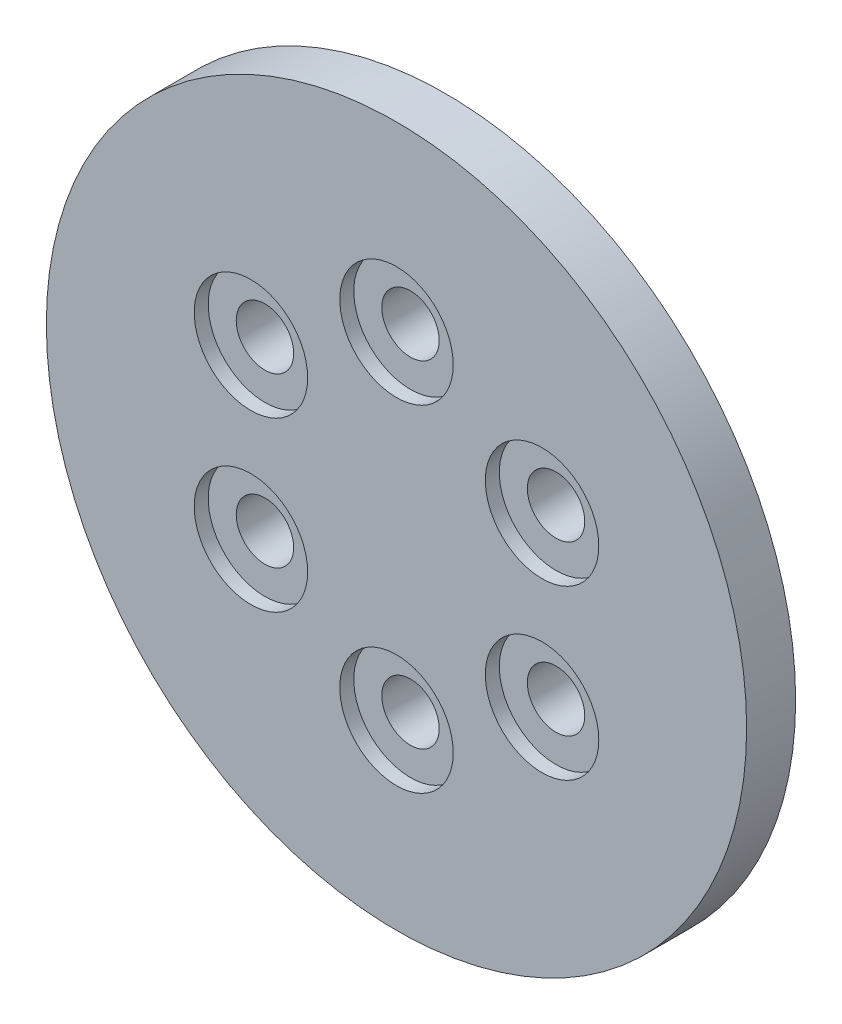
ISO-10303-21;
HEADER;
FILE_DESCRIPTION(('STEP AP214'),'2;1');
FILE_NAME('part.step','',(''),(''),'','','');
FILE_SCHEMA(('AUTOMOTIVE_DESIGN { 1 0 10303 214 1 1 1 1 }'));
ENDSEC;
DATA;
#1=APPLICATION_CONTEXT('core data for automotive mechanical design processes');
#2=APPLICATION_PROTOCOL_DEFINITION('international standard','automotive_design',2000,#1);
#3=PRODUCT_CONTEXT('',#1,'mechanical');
#4=PRODUCT('Part','Part','',(#3));
#5=PRODUCT_RELATED_PRODUCT_CATEGORY('part','',(#4));
#6=PRODUCT_DEFINITION_FORMATION('','',#4);
#7=PRODUCT_DEFINITION_CONTEXT('part definition',#1,'design');
#8=PRODUCT_DEFINITION('design','',#6,#7);
#9=PRODUCT_DEFINITION_SHAPE('','',#8);
#10=(LENGTH_UNIT() NAMED_UNIT(*) SI_UNIT(.MILLI.,.METRE.));
#11=(NAMED_UNIT(*) PLANE_ANGLE_UNIT() SI_UNIT($,.RADIAN.));
#12=(NAMED_UNIT(*) SI_UNIT($,.STERADIAN.) SOLID_ANGLE_UNIT());
#13=UNCERTAINTY_MEASURE_WITH_UNIT(LENGTH_MEASURE(1.E-05),#10,'distance_accuracy_value','');
#14=(GEOMETRIC_REPRESENTATION_CONTEXT(3) GLOBAL_UNCERTAINTY_ASSIGNED_CONTEXT((#13)) GLOBAL_UNIT_ASSIGNED_CONTEXT((#10,
#11,#12)) REPRESENTATION_CONTEXT('',''));
#15=CARTESIAN_POINT('',(0.,0.,0.));
#16=DIRECTION('',(0.,0.,1.));
#17=DIRECTION('',(1.,0.,0.));
#18=AXIS2_PLACEMENT_3D('',#15,#16,#17);
#19=CARTESIAN_POINT('',(0.,0.,4.));
#20=DIRECTION('',(0.,0.,-1.));
#21=DIRECTION('',(-1.,0.,0.));
#22=AXIS2_PLACEMENT_3D('',#19,#20,#21);
#23=CYLINDRICAL_SURFACE('',#22,25.);
#24=CARTESIAN_POINT('',(0.,0.,4.));
#25=DIRECTION('',(0.,0.,1.));
#26=DIRECTION('',(1.,0.,0.));
#27=AXIS2_PLACEMENT_3D('',#24,#25,#26);
#28=CIRCLE('',#27,25.);
#29=CARTESIAN_POINT('',(25.,0.,4.));
#30=VERTEX_POINT('',#29);
#31=EDGE_CURVE('E10',#30,#30,#28,.T.);
#32=ORIENTED_EDGE('',*,*,#31,.F.);
#33=EDGE_LOOP('',(#32));
#34=FACE_BOUND('',#33,.T.);
#35=CARTESIAN_POINT('',(0.,0.,0.5));
#36=DIRECTION('',(0.,0.,-1.));
#37=DIRECTION('',(-1.,0.,0.));
#38=AXIS2_PLACEMENT_3D('',#35,#36,#37);
#39=CIRCLE('',#38,25.);
#40=CARTESIAN_POINT('',(-25.,0.,0.5));
#41=VERTEX_POINT('',#40);
#42=EDGE_CURVE('E145',#41,#41,#39,.T.);
#43=ORIENTED_EDGE('',*,*,#42,.F.);
#44=EDGE_LOOP('',(#43));
#45=FACE_BOUND('',#44,.T.);
#46=ADVANCED_FACE('F38',(#34,#45),#23,.T.);
#47=CARTESIAN_POINT('',(0.,0.,0.));
#48=DIRECTION('',(0.,0.,1.));
#49=DIRECTION('',(1.,0.,0.));
#50=AXIS2_PLACEMENT_3D('',#47,#48,#49);
#51=PLANE('',#50);
#52=CARTESIAN_POINT('',(10.3923048454122,-6.00000000000059,0.));
#53=DIRECTION('',(0.,0.,-1.));
#54=DIRECTION('',(-1.,0.,0.));
#55=AXIS2_PLACEMENT_3D('',#52,#53,#54);
#56=CIRCLE('',#55,2.05000000000126);
#57=CARTESIAN_POINT('',(8.34230484541099,-6.00000000000059,0.));
#58=VERTEX_POINT('',#57);
#59=EDGE_CURVE('E45',#58,#58,#56,.T.);
#60=ORIENTED_EDGE('',*,*,#59,.F.);
#61=EDGE_LOOP('',(#60));
#62=FACE_BOUND('',#61,.T.);
#63=CARTESIAN_POINT('',(10.3923048454129,5.9999999999994,0.));
#64=DIRECTION('',(0.,0.,-1.));
#65=DIRECTION('',(-1.,0.,0.));
#66=AXIS2_PLACEMENT_3D('',#63,#64,#65);
#67=CIRCLE('',#66,2.05000000000064);
#68=CARTESIAN_POINT('',(8.34230484541229,5.9999999999994,0.));
#69=VERTEX_POINT('',#68);
#70=EDGE_CURVE('E50',#69,#69,#67,.T.);
#71=ORIENTED_EDGE('',*,*,#70,.F.);
#72=EDGE_LOOP('',(#71));
#73=FACE_BOUND('',#72,.T.);
#74=CARTESIAN_POINT('',(0.,12.,0.));
#75=DIRECTION('',(0.,0.,-1.));
#76=DIRECTION('',(-1.,0.,0.));
#77=AXIS2_PLACEMENT_3D('',#74,#75,#76);
#78=CIRCLE('',#77,2.05);
#79=CARTESIAN_POINT('',(-2.05,12.,0.));
#80=VERTEX_POINT('',#79);
#81=EDGE_CURVE('E55',#80,#80,#78,.T.);
#82=ORIENTED_EDGE('',*,*,#81,.F.);
#83=EDGE_LOOP('',(#82));
#84=FACE_BOUND('',#83,.T.);
#85=CARTESIAN_POINT('',(-10.3923048454136,6.00000000000059,0.));
#86=DIRECTION('',(0.,0.,-1.));
#87=DIRECTION('',(-1.,0.,0.));
#88=AXIS2_PLACEMENT_3D('',#85,#86,#87);
#89=CIRCLE('',#88,2.05000000000019);
#90=CARTESIAN_POINT('',(-12.4423048454138,6.00000000000059,0.));
#91=VERTEX_POINT('',#90);
#92=EDGE_CURVE('E67',#91,#91,#89,.T.);
#93=ORIENTED_EDGE('',*,*,#92,.F.);
#94=EDGE_LOOP('',(#93));
#95=FACE_BOUND('',#94,.T.);
#96=CARTESIAN_POINT('',(-10.3923048454143,-5.99999999999941,0.));
#97=DIRECTION('',(0.,0.,-1.));
#98=DIRECTION('',(-1.,0.,0.));
#99=AXIS2_PLACEMENT_3D('',#96,#97,#98);
#100=CIRCLE('',#99,2.05000000000086);
#101=CARTESIAN_POINT('',(-12.4423048454151,-5.99999999999941,0.));
#102=VERTEX_POINT('',#101);
#103=EDGE_CURVE('E62',#102,#102,#100,.T.);
#104=ORIENTED_EDGE('',*,*,#103,.F.);
#105=EDGE_LOOP('',(#104));
#106=FACE_BOUND('',#105,.T.);
#107=CARTESIAN_POINT('',(-1.35983332418246E-12,-12.,0.));
#108=DIRECTION('',(0.,0.,-1.));
#109=DIRECTION('',(-1.,0.,0.));
#110=AXIS2_PLACEMENT_3D('',#107,#108,#109);
#111=CIRCLE('',#110,2.05000000000138);
#112=CARTESIAN_POINT('',(-2.05000000000274,-12.,0.));
#113=VERTEX_POINT('',#112);
#114=EDGE_CURVE('E58',#113,#113,#111,.T.);
#115=ORIENTED_EDGE('',*,*,#114,.F.);
#116=EDGE_LOOP('',(#115));
#117=FACE_BOUND('',#116,.T.);
#118=CARTESIAN_POINT('',(0.,0.,0.));
#119=DIRECTION('',(0.,0.,-1.));
#120=DIRECTION('',(-1.,0.,0.));
#121=AXIS2_PLACEMENT_3D('',#118,#119,#120);
#122=CIRCLE('',#121,20.);
#123=CARTESIAN_POINT('',(-20.,0.,0.));
#124=VERTEX_POINT('',#123);
#125=EDGE_CURVE('E150',#124,#124,#122,.T.);
#126=ORIENTED_EDGE('',*,*,#125,.T.);
#127=EDGE_LOOP('',(#126));
#128=FACE_BOUND('',#127,.T.);
#129=ADVANCED_FACE('F169',(#62,#73,#84,#95,#106,#117,#128),#51,.F.);
#130=CARTESIAN_POINT('',(10.3923048454122,-6.00000000000059,10.));
#131=DIRECTION('',(0.,0.,-1.));
#132=DIRECTION('',(-1.,0.,0.));
#133=AXIS2_PLACEMENT_3D('',#130,#131,#132);
#134=CYLINDRICAL_SURFACE('',#133,2.05000000000126);
#135=ORIENTED_EDGE('',*,*,#59,.T.);
#136=EDGE_LOOP('',(#135));
#137=FACE_BOUND('',#136,.T.);
#138=CARTESIAN_POINT('',(10.3923048454122,-6.00000000000059,3.));
#139=DIRECTION('',(0.,0.,1.));
#140=DIRECTION('',(1.,0.,0.));
#141=AXIS2_PLACEMENT_3D('',#138,#139,#140);
#142=CIRCLE('',#141,2.05000000000126);
#143=CARTESIAN_POINT('',(12.4423048454135,-6.00000000000059,3.));
#144=VERTEX_POINT('',#143);
#145=EDGE_CURVE('E95',#144,#144,#142,.T.);
#146=ORIENTED_EDGE('',*,*,#145,.T.);
#147=EDGE_LOOP('',(#146));
#148=FACE_BOUND('',#147,.T.);
#149=ADVANCED_FACE('F174',(#137,#148),#134,.F.);
#150=CARTESIAN_POINT('',(10.3923048454129,5.9999999999994,10.));
#151=DIRECTION('',(0.,0.,-1.));
#152=DIRECTION('',(-1.,0.,0.));
#153=AXIS2_PLACEMENT_3D('',#150,#151,#152);
#154=CYLINDRICAL_SURFACE('',#153,2.05000000000064);
#155=ORIENTED_EDGE('',*,*,#70,.T.);
#156=EDGE_LOOP('',(#155));
#157=FACE_BOUND('',#156,.T.);
#158=CARTESIAN_POINT('',(10.3923048454129,5.9999999999994,3.));
#159=DIRECTION('',(0.,0.,1.));
#160=DIRECTION('',(1.,0.,0.));
#161=AXIS2_PLACEMENT_3D('',#158,#159,#160);
#162=CIRCLE('',#161,2.05000000000064);
#163=CARTESIAN_POINT('',(12.4423048454136,5.9999999999994,3.));
#164=VERTEX_POINT('',#163);
#165=EDGE_CURVE('E91',#164,#164,#162,.T.);
#166=ORIENTED_EDGE('',*,*,#165,.T.);
#167=EDGE_LOOP('',(#166));
#168=FACE_BOUND('',#167,.T.);
#169=ADVANCED_FACE('F180',(#157,#168),#154,.F.);
#170=CARTESIAN_POINT('',(0.,12.,10.));
#171=DIRECTION('',(0.,0.,-1.));
#172=DIRECTION('',(-1.,0.,0.));
#173=AXIS2_PLACEMENT_3D('',#170,#171,#172);
#174=CYLINDRICAL_SURFACE('',#173,2.05);
#175=ORIENTED_EDGE('',*,*,#81,.T.);
#176=EDGE_LOOP('',(#175));
#177=FACE_BOUND('',#176,.T.);
#178=CARTESIAN_POINT('',(0.,12.,3.));
#179=DIRECTION('',(0.,0.,1.));
#180=DIRECTION('',(1.,0.,0.));
#181=AXIS2_PLACEMENT_3D('',#178,#179,#180);
#182=CIRCLE('',#181,2.05);
#183=CARTESIAN_POINT('',(2.05,12.,3.));
#184=VERTEX_POINT('',#183);
#185=EDGE_CURVE('E138',#184,#184,#182,.T.);
#186=ORIENTED_EDGE('',*,*,#185,.T.);
#187=EDGE_LOOP('',(#186));
#188=FACE_BOUND('',#187,.T.);
#189=ADVANCED_FACE('F199',(#177,#188),#174,.F.);
#190=CARTESIAN_POINT('',(-10.3923048454136,6.00000000000059,10.));
#191=DIRECTION('',(0.,0.,-1.));
#192=DIRECTION('',(-1.,0.,0.));
#193=AXIS2_PLACEMENT_3D('',#190,#191,#192);
#194=CYLINDRICAL_SURFACE('',#193,2.05000000000019);
#195=ORIENTED_EDGE('',*,*,#92,.T.);
#196=EDGE_LOOP('',(#195));
#197=FACE_BOUND('',#196,.T.);
#198=CARTESIAN_POINT('',(-10.3923048454136,6.00000000000059,3.));
#199=DIRECTION('',(0.,0.,1.));
#200=DIRECTION('',(1.,0.,0.));
#201=AXIS2_PLACEMENT_3D('',#198,#199,#200);
#202=CIRCLE('',#201,2.05000000000019);
#203=CARTESIAN_POINT('',(-8.34230484541342,6.00000000000059,3.));
#204=VERTEX_POINT('',#203);
#205=EDGE_CURVE('E78',#204,#204,#202,.T.);
#206=ORIENTED_EDGE('',*,*,#205,.T.);
#207=EDGE_LOOP('',(#206));
#208=FACE_BOUND('',#207,.T.);
#209=ADVANCED_FACE('F195',(#197,#208),#194,.F.);
#210=CARTESIAN_POINT('',(-10.3923048454143,-5.99999999999941,10.));
#211=DIRECTION('',(0.,0.,-1.));
#212=DIRECTION('',(-1.,0.,0.));
#213=AXIS2_PLACEMENT_3D('',#210,#211,#212);
#214=CYLINDRICAL_SURFACE('',#213,2.05000000000086);
#215=ORIENTED_EDGE('',*,*,#103,.T.);
#216=EDGE_LOOP('',(#215));
#217=FACE_BOUND('',#216,.T.);
#218=CARTESIAN_POINT('',(-10.3923048454143,-5.99999999999941,3.));
#219=DIRECTION('',(0.,0.,1.));
#220=DIRECTION('',(1.,0.,0.));
#221=AXIS2_PLACEMENT_3D('',#218,#219,#220);
#222=CIRCLE('',#221,2.05000000000086);
#223=CARTESIAN_POINT('',(-8.34230484541343,-5.99999999999941,3.));
#224=VERTEX_POINT('',#223);
#225=EDGE_CURVE('E120',#224,#224,#222,.T.);
#226=ORIENTED_EDGE('',*,*,#225,.T.);
#227=EDGE_LOOP('',(#226));
#228=FACE_BOUND('',#227,.T.);
#229=ADVANCED_FACE('F191',(#217,#228),#214,.F.);
#230=CARTESIAN_POINT('',(-1.35983332418246E-12,-12.,10.));
#231=DIRECTION('',(0.,0.,-1.));
#232=DIRECTION('',(-1.,0.,0.));
#233=AXIS2_PLACEMENT_3D('',#230,#231,#232);
#234=CYLINDRICAL_SURFACE('',#233,2.05000000000138);
#235=ORIENTED_EDGE('',*,*,#114,.T.);
#236=EDGE_LOOP('',(#235));
#237=FACE_BOUND('',#236,.T.);
#238=CARTESIAN_POINT('',(-1.35983332418246E-12,-12.,3.));
#239=DIRECTION('',(0.,0.,1.));
#240=DIRECTION('',(1.,0.,0.));
#241=AXIS2_PLACEMENT_3D('',#238,#239,#240);
#242=CIRCLE('',#241,2.05000000000138);
#243=CARTESIAN_POINT('',(2.05000000000002,-12.,3.));
#244=VERTEX_POINT('',#243);
#245=EDGE_CURVE('E108',#244,#244,#242,.T.);
#246=ORIENTED_EDGE('',*,*,#245,.T.);
#247=EDGE_LOOP('',(#246));
#248=FACE_BOUND('',#247,.T.);
#249=ADVANCED_FACE('F186',(#237,#248),#234,.F.);
#250=CARTESIAN_POINT('',(0.,0.,4.));
#251=DIRECTION('',(0.,0.,1.));
#252=DIRECTION('',(1.,0.,0.));
#253=AXIS2_PLACEMENT_3D('',#250,#251,#252);
#254=PLANE('',#253);
#255=CARTESIAN_POINT('',(-10.3923048454143,-5.99999999999941,4.));
#256=DIRECTION('',(0.,0.,1.));
#257=DIRECTION('',(1.,0.,0.));
#258=AXIS2_PLACEMENT_3D('',#255,#256,#257);
#259=CIRCLE('',#258,4.05000000000086);
#260=CARTESIAN_POINT('',(-6.34230484541343,-5.99999999999941,4.));
#261=VERTEX_POINT('',#260);
#262=EDGE_CURVE('E124',#261,#261,#259,.T.);
#263=ORIENTED_EDGE('',*,*,#262,.F.);
#264=EDGE_LOOP('',(#263));
#265=FACE_BOUND('',#264,.T.);
#266=CARTESIAN_POINT('',(-1.35983332418246E-12,-12.,4.));
#267=DIRECTION('',(0.,0.,1.));
#268=DIRECTION('',(1.,0.,0.));
#269=AXIS2_PLACEMENT_3D('',#266,#267,#268);
#270=CIRCLE('',#269,4.05000000000138);
#271=CARTESIAN_POINT('',(4.05000000000002,-12.,4.));
#272=VERTEX_POINT('',#271);
#273=EDGE_CURVE('E112',#272,#272,#270,.T.);
#274=ORIENTED_EDGE('',*,*,#273,.F.);
#275=EDGE_LOOP('',(#274));
#276=FACE_BOUND('',#275,.T.);
#277=CARTESIAN_POINT('',(10.3923048454122,-6.00000000000059,4.));
#278=DIRECTION('',(0.,0.,1.));
#279=DIRECTION('',(1.,0.,0.));
#280=AXIS2_PLACEMENT_3D('',#277,#278,#279);
#281=CIRCLE('',#280,4.05000000000126);
#282=CARTESIAN_POINT('',(14.4423048454135,-6.00000000000059,4.));
#283=VERTEX_POINT('',#282);
#284=EDGE_CURVE('E100',#283,#283,#281,.T.);
#285=ORIENTED_EDGE('',*,*,#284,.F.);
#286=EDGE_LOOP('',(#285));
#287=FACE_BOUND('',#286,.T.);
#288=CARTESIAN_POINT('',(10.3923048454129,5.9999999999994,4.));
#289=DIRECTION('',(0.,0.,1.));
#290=DIRECTION('',(1.,0.,0.));
#291=AXIS2_PLACEMENT_3D('',#288,#289,#290);
#292=CIRCLE('',#291,4.05000000000064);
#293=CARTESIAN_POINT('',(14.4423048454136,5.9999999999994,4.));
#294=VERTEX_POINT('',#293);
#295=EDGE_CURVE('E86',#294,#294,#292,.T.);
#296=ORIENTED_EDGE('',*,*,#295,.F.);
#297=EDGE_LOOP('',(#296));
#298=FACE_BOUND('',#297,.T.);
#299=CARTESIAN_POINT('',(0.,12.,4.));
#300=DIRECTION('',(0.,0.,1.));
#301=DIRECTION('',(1.,0.,0.));
#302=AXIS2_PLACEMENT_3D('',#299,#300,#301);
#303=CIRCLE('',#302,4.05);
#304=CARTESIAN_POINT('',(4.05,12.,4.));
#305=VERTEX_POINT('',#304);
#306=EDGE_CURVE('E134',#305,#305,#303,.T.);
#307=ORIENTED_EDGE('',*,*,#306,.F.);
#308=EDGE_LOOP('',(#307));
#309=FACE_BOUND('',#308,.T.);
#310=CARTESIAN_POINT('',(-10.3923048454136,6.00000000000059,4.));
#311=DIRECTION('',(0.,0.,1.));
#312=DIRECTION('',(1.,0.,0.));
#313=AXIS2_PLACEMENT_3D('',#310,#311,#312);
#314=CIRCLE('',#313,4.05000000000019);
#315=CARTESIAN_POINT('',(-6.34230484541342,6.00000000000059,4.));
#316=VERTEX_POINT('',#315);
#317=EDGE_CURVE('E74',#316,#316,#314,.T.);
#318=ORIENTED_EDGE('',*,*,#317,.F.);
#319=EDGE_LOOP('',(#318));
#320=FACE_BOUND('',#319,.T.);
#321=ORIENTED_EDGE('',*,*,#31,.T.);
#322=EDGE_LOOP('',(#321));
#323=FACE_BOUND('',#322,.T.);
#324=ADVANCED_FACE('F184',(#265,#276,#287,#298,#309,#320,#323),#254,.T.);
#325=CARTESIAN_POINT('',(-1.35983332418246E-12,-12.,3.));
#326=DIRECTION('',(0.,0.,1.));
#327=DIRECTION('',(1.,0.,0.));
#328=AXIS2_PLACEMENT_3D('',#325,#326,#327);
#329=CYLINDRICAL_SURFACE('',#328,4.05000000000138);
#330=CARTESIAN_POINT('',(-1.35983332418246E-12,-12.,3.));
#331=DIRECTION('',(0.,0.,1.));
#332=DIRECTION('',(1.,0.,0.));
#333=AXIS2_PLACEMENT_3D('',#330,#331,#332);
#334=CIRCLE('',#333,4.05000000000138);
#335=CARTESIAN_POINT('',(4.05000000000002,-12.,3.));
#336=VERTEX_POINT('',#335);
#337=EDGE_CURVE('E116',#336,#336,#334,.T.);
#338=ORIENTED_EDGE('',*,*,#337,.F.);
#339=EDGE_LOOP('',(#338));
#340=FACE_BOUND('',#339,.T.);
#341=ORIENTED_EDGE('',*,*,#273,.T.);
#342=EDGE_LOOP('',(#341));
#343=FACE_BOUND('',#342,.T.);
#344=ADVANCED_FACE('F185',(#340,#343),#329,.F.);
#345=CARTESIAN_POINT('',(-1.35983332418246E-12,-12.,3.));
#346=DIRECTION('',(0.,0.,1.));
#347=DIRECTION('',(1.,0.,0.));
#348=AXIS2_PLACEMENT_3D('',#345,#346,#347);
#349=PLANE('',#348);
#350=ORIENTED_EDGE('',*,*,#245,.F.);
#351=EDGE_LOOP('',(#350));
#352=FACE_BOUND('',#351,.T.);
#353=ORIENTED_EDGE('',*,*,#337,.T.);
#354=EDGE_LOOP('',(#353));
#355=FACE_BOUND('',#354,.T.);
#356=ADVANCED_FACE('F235',(#352,#355),#349,.T.);
#357=CARTESIAN_POINT('',(-10.3923048454143,-5.99999999999941,3.));
#358=DIRECTION('',(0.,0.,1.));
#359=DIRECTION('',(1.,0.,0.));
#360=AXIS2_PLACEMENT_3D('',#357,#358,#359);
#361=CYLINDRICAL_SURFACE('',#360,4.05000000000086);
#362=CARTESIAN_POINT('',(-10.3923048454143,-5.99999999999941,3.));
#363=DIRECTION('',(0.,0.,1.));
#364=DIRECTION('',(1.,0.,0.));
#365=AXIS2_PLACEMENT_3D('',#362,#363,#364);
#366=CIRCLE('',#365,4.05000000000086);
#367=CARTESIAN_POINT('',(-6.34230484541343,-5.99999999999941,3.));
#368=VERTEX_POINT('',#367);
#369=EDGE_CURVE('E85',#368,#368,#366,.T.);
#370=ORIENTED_EDGE('',*,*,#369,.F.);
#371=EDGE_LOOP('',(#370));
#372=FACE_BOUND('',#371,.T.);
#373=ORIENTED_EDGE('',*,*,#262,.T.);
#374=EDGE_LOOP('',(#373));
#375=FACE_BOUND('',#374,.T.);
#376=ADVANCED_FACE('F239',(#372,#375),#361,.F.);
#377=CARTESIAN_POINT('',(-10.3923048454143,-5.99999999999941,3.));
#378=DIRECTION('',(0.,0.,1.));
#379=DIRECTION('',(1.,0.,0.));
#380=AXIS2_PLACEMENT_3D('',#377,#378,#379);
#381=PLANE('',#380);
#382=ORIENTED_EDGE('',*,*,#225,.F.);
#383=EDGE_LOOP('',(#382));
#384=FACE_BOUND('',#383,.T.);
#385=ORIENTED_EDGE('',*,*,#369,.T.);
#386=EDGE_LOOP('',(#385));
#387=FACE_BOUND('',#386,.T.);
#388=ADVANCED_FACE('F211',(#384,#387),#381,.T.);
#389=CARTESIAN_POINT('',(-10.3923048454136,6.00000000000059,3.));
#390=DIRECTION('',(0.,0.,1.));
#391=DIRECTION('',(1.,0.,0.));
#392=AXIS2_PLACEMENT_3D('',#389,#390,#391);
#393=CYLINDRICAL_SURFACE('',#392,4.05000000000019);
#394=CARTESIAN_POINT('',(-10.3923048454136,6.00000000000059,3.));
#395=DIRECTION('',(0.,0.,1.));
#396=DIRECTION('',(1.,0.,0.));
#397=AXIS2_PLACEMENT_3D('',#394,#395,#396);
#398=CIRCLE('',#397,4.05000000000019);
#399=CARTESIAN_POINT('',(-6.34230484541342,6.00000000000059,3.));
#400=VERTEX_POINT('',#399);
#401=EDGE_CURVE('E63',#400,#400,#398,.T.);
#402=ORIENTED_EDGE('',*,*,#401,.F.);
#403=EDGE_LOOP('',(#402));
#404=FACE_BOUND('',#403,.T.);
#405=ORIENTED_EDGE('',*,*,#317,.T.);
#406=EDGE_LOOP('',(#405));
#407=FACE_BOUND('',#406,.T.);
#408=ADVANCED_FACE('F207',(#404,#407),#393,.F.);
#409=CARTESIAN_POINT('',(-10.3923048454136,6.00000000000059,3.));
#410=DIRECTION('',(0.,0.,1.));
#411=DIRECTION('',(1.,0.,0.));
#412=AXIS2_PLACEMENT_3D('',#409,#410,#411);
#413=PLANE('',#412);
#414=ORIENTED_EDGE('',*,*,#205,.F.);
#415=EDGE_LOOP('',(#414));
#416=FACE_BOUND('',#415,.T.);
#417=ORIENTED_EDGE('',*,*,#401,.T.);
#418=EDGE_LOOP('',(#417));
#419=FACE_BOUND('',#418,.T.);
#420=ADVANCED_FACE('F210',(#416,#419),#413,.T.);
#421=CARTESIAN_POINT('',(0.,12.,3.));
#422=DIRECTION('',(0.,0.,1.));
#423=DIRECTION('',(1.,0.,0.));
#424=AXIS2_PLACEMENT_3D('',#421,#422,#423);
#425=CYLINDRICAL_SURFACE('',#424,4.05);
#426=CARTESIAN_POINT('',(0.,12.,3.));
#427=DIRECTION('',(0.,0.,1.));
#428=DIRECTION('',(1.,0.,0.));
#429=AXIS2_PLACEMENT_3D('',#426,#427,#428);
#430=CIRCLE('',#429,4.05);
#431=CARTESIAN_POINT('',(4.05,12.,3.));
#432=VERTEX_POINT('',#431);
#433=EDGE_CURVE('E99',#432,#432,#430,.T.);
#434=ORIENTED_EDGE('',*,*,#433,.F.);
#435=EDGE_LOOP('',(#434));
#436=FACE_BOUND('',#435,.T.);
#437=ORIENTED_EDGE('',*,*,#306,.T.);
#438=EDGE_LOOP('',(#437));
#439=FACE_BOUND('',#438,.T.);
#440=ADVANCED_FACE('F215',(#436,#439),#425,.F.);
#441=CARTESIAN_POINT('',(0.,12.,3.));
#442=DIRECTION('',(0.,0.,1.));
#443=DIRECTION('',(1.,0.,0.));
#444=AXIS2_PLACEMENT_3D('',#441,#442,#443);
#445=PLANE('',#444);
#446=ORIENTED_EDGE('',*,*,#185,.F.);
#447=EDGE_LOOP('',(#446));
#448=FACE_BOUND('',#447,.T.);
#449=ORIENTED_EDGE('',*,*,#433,.T.);
#450=EDGE_LOOP('',(#449));
#451=FACE_BOUND('',#450,.T.);
#452=ADVANCED_FACE('F221',(#448,#451),#445,.T.);
#453=CARTESIAN_POINT('',(10.3923048454129,5.9999999999994,3.));
#454=DIRECTION('',(0.,0.,1.));
#455=DIRECTION('',(1.,0.,0.));
#456=AXIS2_PLACEMENT_3D('',#453,#454,#455);
#457=CYLINDRICAL_SURFACE('',#456,4.05000000000064);
#458=CARTESIAN_POINT('',(10.3923048454129,5.9999999999994,3.));
#459=DIRECTION('',(0.,0.,1.));
#460=DIRECTION('',(1.,0.,0.));
#461=AXIS2_PLACEMENT_3D('',#458,#459,#460);
#462=CIRCLE('',#461,4.05000000000064);
#463=CARTESIAN_POINT('',(14.4423048454136,5.9999999999994,3.));
#464=VERTEX_POINT('',#463);
#465=EDGE_CURVE('E90',#464,#464,#462,.T.);
#466=ORIENTED_EDGE('',*,*,#465,.F.);
#467=EDGE_LOOP('',(#466));
#468=FACE_BOUND('',#467,.T.);
#469=ORIENTED_EDGE('',*,*,#295,.T.);
#470=EDGE_LOOP('',(#469));
#471=FACE_BOUND('',#470,.T.);
#472=ADVANCED_FACE('F217',(#468,#471),#457,.F.);
#473=CARTESIAN_POINT('',(10.3923048454129,5.9999999999994,3.));
#474=DIRECTION('',(0.,0.,1.));
#475=DIRECTION('',(1.,0.,0.));
#476=AXIS2_PLACEMENT_3D('',#473,#474,#475);
#477=PLANE('',#476);
#478=ORIENTED_EDGE('',*,*,#165,.F.);
#479=EDGE_LOOP('',(#478));
#480=FACE_BOUND('',#479,.T.);
#481=ORIENTED_EDGE('',*,*,#465,.T.);
#482=EDGE_LOOP('',(#481));
#483=FACE_BOUND('',#482,.T.);
#484=ADVANCED_FACE('F220',(#480,#483),#477,.T.);
#485=CARTESIAN_POINT('',(10.3923048454122,-6.00000000000059,3.));
#486=DIRECTION('',(0.,0.,1.));
#487=DIRECTION('',(1.,0.,0.));
#488=AXIS2_PLACEMENT_3D('',#485,#486,#487);
#489=CYLINDRICAL_SURFACE('',#488,4.05000000000126);
#490=CARTESIAN_POINT('',(10.3923048454122,-6.00000000000059,3.));
#491=DIRECTION('',(0.,0.,1.));
#492=DIRECTION('',(1.,0.,0.));
#493=AXIS2_PLACEMENT_3D('',#490,#491,#492);
#494=CIRCLE('',#493,4.05000000000126);
#495=CARTESIAN_POINT('',(14.4423048454135,-6.00000000000059,3.));
#496=VERTEX_POINT('',#495);
#497=EDGE_CURVE('E104',#496,#496,#494,.T.);
#498=ORIENTED_EDGE('',*,*,#497,.F.);
#499=EDGE_LOOP('',(#498));
#500=FACE_BOUND('',#499,.T.);
#501=ORIENTED_EDGE('',*,*,#284,.T.);
#502=EDGE_LOOP('',(#501));
#503=FACE_BOUND('',#502,.T.);
#504=ADVANCED_FACE('F225',(#500,#503),#489,.F.);
#505=CARTESIAN_POINT('',(10.3923048454122,-6.00000000000059,3.));
#506=DIRECTION('',(0.,0.,1.));
#507=DIRECTION('',(1.,0.,0.));
#508=AXIS2_PLACEMENT_3D('',#505,#506,#507);
#509=PLANE('',#508);
#510=ORIENTED_EDGE('',*,*,#145,.F.);
#511=EDGE_LOOP('',(#510));
#512=FACE_BOUND('',#511,.T.);
#513=ORIENTED_EDGE('',*,*,#497,.T.);
#514=EDGE_LOOP('',(#513));
#515=FACE_BOUND('',#514,.T.);
#516=ADVANCED_FACE('F164',(#512,#515),#509,.T.);
#517=CARTESIAN_POINT('',(0.,0.,0.5));
#518=DIRECTION('',(0.,0.,-1.));
#519=DIRECTION('',(-1.,0.,0.));
#520=AXIS2_PLACEMENT_3D('',#517,#518,#519);
#521=PLANE('',#520);
#522=CARTESIAN_POINT('',(0.,0.,0.5));
#523=DIRECTION('',(0.,0.,-1.));
#524=DIRECTION('',(-1.,0.,0.));
#525=AXIS2_PLACEMENT_3D('',#522,#523,#524);
#526=CIRCLE('',#525,20.);
#527=CARTESIAN_POINT('',(-20.,0.,0.5));
#528=VERTEX_POINT('',#527);
#529=EDGE_CURVE('E149',#528,#528,#526,.T.);
#530=ORIENTED_EDGE('',*,*,#529,.F.);
#531=EDGE_LOOP('',(#530));
#532=FACE_BOUND('',#531,.T.);
#533=ORIENTED_EDGE('',*,*,#42,.T.);
#534=EDGE_LOOP('',(#533));
#535=FACE_BOUND('',#534,.T.);
#536=ADVANCED_FACE('F161',(#532,#535),#521,.T.);
#537=CARTESIAN_POINT('',(0.,0.,0.5));
#538=DIRECTION('',(0.,0.,-1.));
#539=DIRECTION('',(-1.,0.,0.));
#540=AXIS2_PLACEMENT_3D('',#537,#538,#539);
#541=CYLINDRICAL_SURFACE('',#540,20.);
#542=ORIENTED_EDGE('',*,*,#529,.T.);
#543=EDGE_LOOP('',(#542));
#544=FACE_BOUND('',#543,.T.);
#545=ORIENTED_EDGE('',*,*,#125,.F.);
#546=EDGE_LOOP('',(#545));
#547=FACE_BOUND('',#546,.T.);
#548=ADVANCED_FACE('F158',(#544,#547),#541,.T.);
#549=CLOSED_SHELL('',(#46,#129,#149,#169,#189,#209,#229,#249,#324,#344,#356,#376,#388,#408,#420,
#440,#452,#472,#484,#504,#516,#536,#548));
#550=MANIFOLD_SOLID_BREP('B2',#549);
#551=ADVANCED_BREP_SHAPE_REPRESENTATION('',(#18,#550),#14);
#552=SHAPE_DEFINITION_REPRESENTATION(#9,#551);
ENDSEC;
END-ISO-10303-21;
